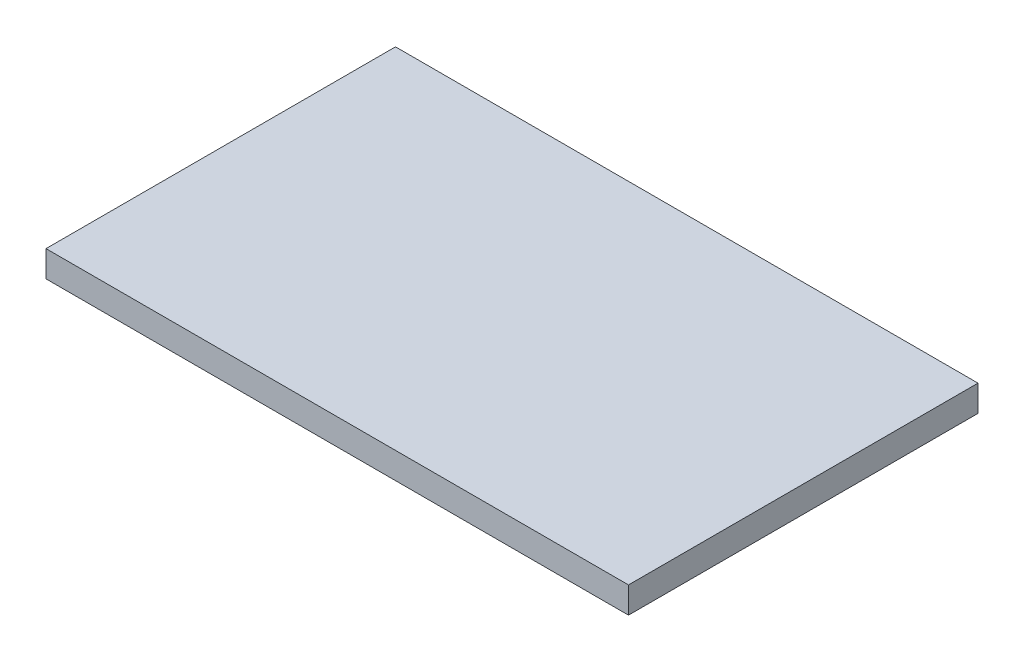
ISO-10303-21;
HEADER;
FILE_DESCRIPTION(('STEP AP214'),'2;1');
FILE_NAME('part.step','',(''),(''),'','','');
FILE_SCHEMA(('AUTOMOTIVE_DESIGN { 1 0 10303 214 1 1 1 1 }'));
ENDSEC;
DATA;
#1=APPLICATION_CONTEXT('core data for automotive mechanical design processes');
#2=APPLICATION_PROTOCOL_DEFINITION('international standard','automotive_design',2000,#1);
#3=PRODUCT_CONTEXT('',#1,'mechanical');
#4=PRODUCT('Part','Part','',(#3));
#5=PRODUCT_RELATED_PRODUCT_CATEGORY('part','',(#4));
#6=PRODUCT_DEFINITION_FORMATION('','',#4);
#7=PRODUCT_DEFINITION_CONTEXT('part definition',#1,'design');
#8=PRODUCT_DEFINITION('design','',#6,#7);
#9=PRODUCT_DEFINITION_SHAPE('','',#8);
#10=(LENGTH_UNIT() NAMED_UNIT(*) SI_UNIT(.MILLI.,.METRE.));
#11=(NAMED_UNIT(*) PLANE_ANGLE_UNIT() SI_UNIT($,.RADIAN.));
#12=(NAMED_UNIT(*) SI_UNIT($,.STERADIAN.) SOLID_ANGLE_UNIT());
#13=UNCERTAINTY_MEASURE_WITH_UNIT(LENGTH_MEASURE(1.E-05),#10,'distance_accuracy_value','');
#14=(GEOMETRIC_REPRESENTATION_CONTEXT(3) GLOBAL_UNCERTAINTY_ASSIGNED_CONTEXT((#13)) GLOBAL_UNIT_ASSIGNED_CONTEXT((#10,
#11,#12)) REPRESENTATION_CONTEXT('',''));
#15=CARTESIAN_POINT('',(0.,0.,0.));
#16=DIRECTION('',(0.,0.,1.));
#17=DIRECTION('',(1.,0.,0.));
#18=AXIS2_PLACEMENT_3D('',#15,#16,#17);
#19=CARTESIAN_POINT('',(0.,0.45,0.));
#20=DIRECTION('',(1.,0.,0.));
#21=DIRECTION('',(0.,0.,-1.));
#22=AXIS2_PLACEMENT_3D('',#19,#20,#21);
#23=PLANE('',#22);
#24=DIRECTION('',(0.,0.,1.));
#25=VECTOR('',#24,1.);
#26=CARTESIAN_POINT('',(0.,0.,0.));
#27=LINE('',#26,#25);
#28=CARTESIAN_POINT('',(0.,0.,-6.));
#29=VERTEX_POINT('',#28);
#30=CARTESIAN_POINT('',(0.,0.,0.));
#31=VERTEX_POINT('',#30);
#32=EDGE_CURVE('E96',#29,#31,#27,.T.);
#33=ORIENTED_EDGE('',*,*,#32,.T.);
#34=DIRECTION('',(0.,-1.,0.));
#35=VECTOR('',#34,1.);
#36=CARTESIAN_POINT('',(0.,0.45,0.));
#37=LINE('',#36,#35);
#38=CARTESIAN_POINT('',(0.,0.45,0.));
#39=VERTEX_POINT('',#38);
#40=EDGE_CURVE('E11',#39,#31,#37,.T.);
#41=ORIENTED_EDGE('',*,*,#40,.F.);
#42=DIRECTION('',(0.,0.,1.));
#43=VECTOR('',#42,1.);
#44=CARTESIAN_POINT('',(0.,0.45,0.));
#45=LINE('',#44,#43);
#46=CARTESIAN_POINT('',(0.,0.45,-6.));
#47=VERTEX_POINT('',#46);
#48=EDGE_CURVE('E84',#47,#39,#45,.T.);
#49=ORIENTED_EDGE('',*,*,#48,.F.);
#50=DIRECTION('',(0.,-1.,0.));
#51=VECTOR('',#50,1.);
#52=CARTESIAN_POINT('',(0.,0.45,-6.));
#53=LINE('',#52,#51);
#54=EDGE_CURVE('E92',#47,#29,#53,.T.);
#55=ORIENTED_EDGE('',*,*,#54,.T.);
#56=EDGE_LOOP('',(#33,#41,#49,#55));
#57=FACE_BOUND('',#56,.T.);
#58=ADVANCED_FACE('F33',(#57),#23,.F.);
#59=CARTESIAN_POINT('',(0.,0.45,0.));
#60=DIRECTION('',(0.,0.,-1.));
#61=DIRECTION('',(-1.,0.,0.));
#62=AXIS2_PLACEMENT_3D('',#59,#60,#61);
#63=PLANE('',#62);
#64=DIRECTION('',(1.,0.,0.));
#65=VECTOR('',#64,1.);
#66=CARTESIAN_POINT('',(0.,0.,0.));
#67=LINE('',#66,#65);
#68=CARTESIAN_POINT('',(10.,0.,0.));
#69=VERTEX_POINT('',#68);
#70=EDGE_CURVE('E88',#31,#69,#67,.T.);
#71=ORIENTED_EDGE('',*,*,#70,.T.);
#72=DIRECTION('',(0.,-1.,0.));
#73=VECTOR('',#72,1.);
#74=CARTESIAN_POINT('',(10.,0.45,0.));
#75=LINE('',#74,#73);
#76=CARTESIAN_POINT('',(10.,0.45,0.));
#77=VERTEX_POINT('',#76);
#78=EDGE_CURVE('E41',#77,#69,#75,.T.);
#79=ORIENTED_EDGE('',*,*,#78,.F.);
#80=DIRECTION('',(1.,0.,0.));
#81=VECTOR('',#80,1.);
#82=CARTESIAN_POINT('',(0.,0.45,0.));
#83=LINE('',#82,#81);
#84=EDGE_CURVE('E79',#39,#77,#83,.T.);
#85=ORIENTED_EDGE('',*,*,#84,.F.);
#86=ORIENTED_EDGE('',*,*,#40,.T.);
#87=EDGE_LOOP('',(#71,#79,#85,#86));
#88=FACE_BOUND('',#87,.T.);
#89=ADVANCED_FACE('F87',(#88),#63,.F.);
#90=CARTESIAN_POINT('',(10.,0.45,0.));
#91=DIRECTION('',(-1.,0.,0.));
#92=DIRECTION('',(0.,0.,1.));
#93=AXIS2_PLACEMENT_3D('',#90,#91,#92);
#94=PLANE('',#93);
#95=DIRECTION('',(0.,0.,-1.));
#96=VECTOR('',#95,1.);
#97=CARTESIAN_POINT('',(10.,0.,0.));
#98=LINE('',#97,#96);
#99=CARTESIAN_POINT('',(10.,0.,-6.));
#100=VERTEX_POINT('',#99);
#101=EDGE_CURVE('E66',#69,#100,#98,.T.);
#102=ORIENTED_EDGE('',*,*,#101,.T.);
#103=DIRECTION('',(0.,-1.,0.));
#104=VECTOR('',#103,1.);
#105=CARTESIAN_POINT('',(10.,0.45,-6.));
#106=LINE('',#105,#104);
#107=CARTESIAN_POINT('',(10.,0.45,-6.));
#108=VERTEX_POINT('',#107);
#109=EDGE_CURVE('E89',#108,#100,#106,.T.);
#110=ORIENTED_EDGE('',*,*,#109,.F.);
#111=DIRECTION('',(0.,0.,-1.));
#112=VECTOR('',#111,1.);
#113=CARTESIAN_POINT('',(10.,0.45,0.));
#114=LINE('',#113,#112);
#115=EDGE_CURVE('E82',#77,#108,#114,.T.);
#116=ORIENTED_EDGE('',*,*,#115,.F.);
#117=ORIENTED_EDGE('',*,*,#78,.T.);
#118=EDGE_LOOP('',(#102,#110,#116,#117));
#119=FACE_BOUND('',#118,.T.);
#120=ADVANCED_FACE('F90',(#119),#94,.F.);
#121=CARTESIAN_POINT('',(0.,0.45,-6.));
#122=DIRECTION('',(0.,0.,1.));
#123=DIRECTION('',(1.,0.,0.));
#124=AXIS2_PLACEMENT_3D('',#121,#122,#123);
#125=PLANE('',#124);
#126=DIRECTION('',(-1.,0.,0.));
#127=VECTOR('',#126,1.);
#128=CARTESIAN_POINT('',(0.,0.,-6.));
#129=LINE('',#128,#127);
#130=EDGE_CURVE('E72',#100,#29,#129,.T.);
#131=ORIENTED_EDGE('',*,*,#130,.T.);
#132=ORIENTED_EDGE('',*,*,#54,.F.);
#133=DIRECTION('',(-1.,0.,0.));
#134=VECTOR('',#133,1.);
#135=CARTESIAN_POINT('',(0.,0.45,-6.));
#136=LINE('',#135,#134);
#137=EDGE_CURVE('E49',#108,#47,#136,.T.);
#138=ORIENTED_EDGE('',*,*,#137,.F.);
#139=ORIENTED_EDGE('',*,*,#109,.T.);
#140=EDGE_LOOP('',(#131,#132,#138,#139));
#141=FACE_BOUND('',#140,.T.);
#142=ADVANCED_FACE('F103',(#141),#125,.F.);
#143=CARTESIAN_POINT('',(0.,0.45,0.));
#144=DIRECTION('',(0.,-1.,0.));
#145=DIRECTION('',(0.,0.,-1.));
#146=AXIS2_PLACEMENT_3D('',#143,#144,#145);
#147=PLANE('',#146);
#148=ORIENTED_EDGE('',*,*,#48,.T.);
#149=ORIENTED_EDGE('',*,*,#84,.T.);
#150=ORIENTED_EDGE('',*,*,#115,.T.);
#151=ORIENTED_EDGE('',*,*,#137,.T.);
#152=EDGE_LOOP('',(#148,#149,#150,#151));
#153=FACE_BOUND('',#152,.T.);
#154=ADVANCED_FACE('F80',(#153),#147,.F.);
#155=CARTESIAN_POINT('',(0.,0.,0.));
#156=DIRECTION('',(0.,-1.,0.));
#157=DIRECTION('',(0.,0.,-1.));
#158=AXIS2_PLACEMENT_3D('',#155,#156,#157);
#159=PLANE('',#158);
#160=ORIENTED_EDGE('',*,*,#32,.F.);
#161=ORIENTED_EDGE('',*,*,#130,.F.);
#162=ORIENTED_EDGE('',*,*,#101,.F.);
#163=ORIENTED_EDGE('',*,*,#70,.F.);
#164=EDGE_LOOP('',(#160,#161,#162,#163));
#165=FACE_BOUND('',#164,.T.);
#166=ADVANCED_FACE('F106',(#165),#159,.T.);
#167=CLOSED_SHELL('',(#58,#89,#120,#142,#154,#166));
#168=MANIFOLD_SOLID_BREP('B2',#167);
#169=ADVANCED_BREP_SHAPE_REPRESENTATION('',(#18,#168),#14);
#170=SHAPE_DEFINITION_REPRESENTATION(#9,#169);
ENDSEC;
END-ISO-10303-21;
